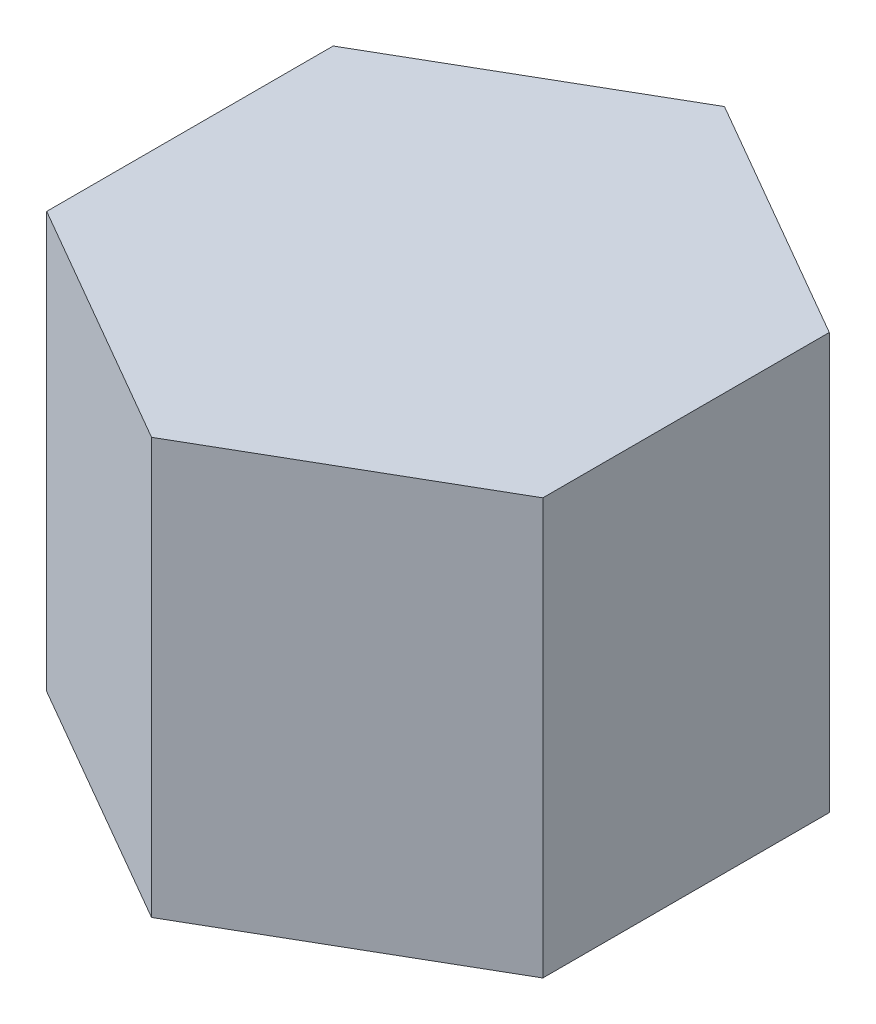
ISO-10303-21;
HEADER;
FILE_DESCRIPTION(('STEP AP214'),'2;1');
FILE_NAME('part.step','',(''),(''),'','','');
FILE_SCHEMA(('AUTOMOTIVE_DESIGN { 1 0 10303 214 1 1 1 1 }'));
ENDSEC;
DATA;
#1=APPLICATION_CONTEXT('core data for automotive mechanical design processes');
#2=APPLICATION_PROTOCOL_DEFINITION('international standard','automotive_design',2000,#1);
#3=PRODUCT_CONTEXT('',#1,'mechanical');
#4=PRODUCT('Part','Part','',(#3));
#5=PRODUCT_RELATED_PRODUCT_CATEGORY('part','',(#4));
#6=PRODUCT_DEFINITION_FORMATION('','',#4);
#7=PRODUCT_DEFINITION_CONTEXT('part definition',#1,'design');
#8=PRODUCT_DEFINITION('design','',#6,#7);
#9=PRODUCT_DEFINITION_SHAPE('','',#8);
#10=(LENGTH_UNIT() NAMED_UNIT(*) SI_UNIT(.MILLI.,.METRE.));
#11=(NAMED_UNIT(*) PLANE_ANGLE_UNIT() SI_UNIT($,.RADIAN.));
#12=(NAMED_UNIT(*) SI_UNIT($,.STERADIAN.) SOLID_ANGLE_UNIT());
#13=UNCERTAINTY_MEASURE_WITH_UNIT(LENGTH_MEASURE(1.E-05),#10,'distance_accuracy_value','');
#14=(GEOMETRIC_REPRESENTATION_CONTEXT(3) GLOBAL_UNCERTAINTY_ASSIGNED_CONTEXT((#13)) GLOBAL_UNIT_ASSIGNED_CONTEXT((#10,
#11,#12)) REPRESENTATION_CONTEXT('',''));
#15=CARTESIAN_POINT('',(0.,0.,0.));
#16=DIRECTION('',(0.,0.,1.));
#17=DIRECTION('',(1.,0.,0.));
#18=AXIS2_PLACEMENT_3D('',#15,#16,#17);
#19=CARTESIAN_POINT('',(204.642660308706,-148.537700895744,288.042869605357));
#20=DIRECTION('',(-0.499999999999943,0.,-0.866025403784472));
#21=DIRECTION('',(-0.866025403784472,0.,0.499999999999943));
#22=AXIS2_PLACEMENT_3D('',#19,#20,#21);
#23=PLANE('',#22);
#24=CARTESIAN_POINT('',(204.339551417382,-149.045793579175,288.217869605357));
#25=DIRECTION('',(0.866025403784471,0.,-0.499999999999943));
#26=VECTOR('',#25,1.);
#27=LINE('',#24,#26);
#28=CARTESIAN_POINT('',(204.339551417382,-149.045793579175,288.217869605357));
#29=VERTEX_POINT('',#28);
#30=CARTESIAN_POINT('',(204.642660308706,-149.045793579175,288.042869605357));
#31=VERTEX_POINT('',#30);
#32=EDGE_CURVE('E170',#29,#31,#27,.T.);
#33=ORIENTED_EDGE('',*,*,#32,.T.);
#34=CARTESIAN_POINT('',(204.642660308706,-148.537700895744,288.042869605357));
#35=DIRECTION('',(0.,-1.,0.));
#36=VECTOR('',#35,1.);
#37=LINE('',#34,#36);
#38=CARTESIAN_POINT('',(204.642660308706,-148.537700895744,288.042869605357));
#39=VERTEX_POINT('',#38);
#40=EDGE_CURVE('E35',#39,#31,#37,.T.);
#41=ORIENTED_EDGE('',*,*,#40,.F.);
#42=CARTESIAN_POINT('',(204.339551417382,-148.537700895744,288.217869605357));
#43=DIRECTION('',(0.866025403784471,0.,-0.499999999999943));
#44=VECTOR('',#43,1.);
#45=LINE('',#42,#44);
#46=CARTESIAN_POINT('',(204.339551417382,-148.537700895744,288.217869605357));
#47=VERTEX_POINT('',#46);
#48=EDGE_CURVE('E159',#47,#39,#45,.T.);
#49=ORIENTED_EDGE('',*,*,#48,.F.);
#50=CARTESIAN_POINT('',(204.339551417382,-148.537700895744,288.217869605357));
#51=DIRECTION('',(0.,-1.,0.));
#52=VECTOR('',#51,1.);
#53=LINE('',#50,#52);
#54=EDGE_CURVE('E10',#47,#29,#53,.T.);
#55=ORIENTED_EDGE('',*,*,#54,.T.);
#56=EDGE_LOOP('',(#33,#41,#49,#55));
#57=FACE_BOUND('',#56,.T.);
#58=ADVANCED_FACE('F16',(#57),#23,.F.);
#59=CARTESIAN_POINT('',(204.339551417382,-148.537700895744,288.217869605357));
#60=DIRECTION('',(0.499999999999978,0.,-0.866025403784452));
#61=DIRECTION('',(-0.866025403784452,0.,-0.499999999999978));
#62=AXIS2_PLACEMENT_3D('',#59,#60,#61);
#63=PLANE('',#62);
#64=CARTESIAN_POINT('',(204.036442526057,-149.045793579175,288.042869605357));
#65=DIRECTION('',(0.866025403784452,0.,0.499999999999978));
#66=VECTOR('',#65,1.);
#67=LINE('',#64,#66);
#68=CARTESIAN_POINT('',(204.036442526057,-149.045793579175,288.042869605357));
#69=VERTEX_POINT('',#68);
#70=EDGE_CURVE('E167',#69,#29,#67,.T.);
#71=ORIENTED_EDGE('',*,*,#70,.T.);
#72=ORIENTED_EDGE('',*,*,#54,.F.);
#73=CARTESIAN_POINT('',(204.036442526057,-148.537700895744,288.042869605357));
#74=DIRECTION('',(0.866025403784452,0.,0.499999999999978));
#75=VECTOR('',#74,1.);
#76=LINE('',#73,#75);
#77=CARTESIAN_POINT('',(204.036442526057,-148.537700895744,288.042869605357));
#78=VERTEX_POINT('',#77);
#79=EDGE_CURVE('E156',#78,#47,#76,.T.);
#80=ORIENTED_EDGE('',*,*,#79,.F.);
#81=CARTESIAN_POINT('',(204.036442526057,-148.537700895744,288.042869605357));
#82=DIRECTION('',(0.,-1.,0.));
#83=VECTOR('',#82,1.);
#84=LINE('',#81,#83);
#85=EDGE_CURVE('E27',#78,#69,#84,.T.);
#86=ORIENTED_EDGE('',*,*,#85,.T.);
#87=EDGE_LOOP('',(#71,#72,#80,#86));
#88=FACE_BOUND('',#87,.T.);
#89=ADVANCED_FACE('F189',(#88),#63,.F.);
#90=CARTESIAN_POINT('',(204.036442526057,-148.537700895744,290.831971220494));
#91=DIRECTION('',(1.,0.,0.));
#92=DIRECTION('',(0.,1.,0.));
#93=AXIS2_PLACEMENT_3D('',#90,#91,#92);
#94=PLANE('',#93);
#95=CARTESIAN_POINT('',(204.036442526057,-149.045793579175,287.692869605357));
#96=DIRECTION('',(0.,0.,1.));
#97=VECTOR('',#96,1.);
#98=LINE('',#95,#97);
#99=CARTESIAN_POINT('',(204.036442526057,-149.045793579175,287.692869605357));
#100=VERTEX_POINT('',#99);
#101=EDGE_CURVE('E163',#100,#69,#98,.T.);
#102=ORIENTED_EDGE('',*,*,#101,.T.);
#103=ORIENTED_EDGE('',*,*,#85,.F.);
#104=CARTESIAN_POINT('',(204.036442526057,-148.537700895744,287.692869605357));
#105=DIRECTION('',(0.,0.,1.));
#106=VECTOR('',#105,1.);
#107=LINE('',#104,#106);
#108=CARTESIAN_POINT('',(204.036442526057,-148.537700895744,287.692869605357));
#109=VERTEX_POINT('',#108);
#110=EDGE_CURVE('E106',#109,#78,#107,.T.);
#111=ORIENTED_EDGE('',*,*,#110,.F.);
#112=CARTESIAN_POINT('',(204.036442526057,-148.537700895744,287.692869605357));
#113=DIRECTION('',(0.,-1.,0.));
#114=VECTOR('',#113,1.);
#115=LINE('',#112,#114);
#116=EDGE_CURVE('E94',#109,#100,#115,.T.);
#117=ORIENTED_EDGE('',*,*,#116,.T.);
#118=EDGE_LOOP('',(#102,#103,#111,#117));
#119=FACE_BOUND('',#118,.T.);
#120=ADVANCED_FACE('F198',(#119),#94,.F.);
#121=CARTESIAN_POINT('',(204.036442526057,-148.537700895744,287.692869605357));
#122=DIRECTION('',(0.499999999999978,0.,0.866025403784452));
#123=DIRECTION('',(0.866025403784452,0.,-0.499999999999978));
#124=AXIS2_PLACEMENT_3D('',#121,#122,#123);
#125=PLANE('',#124);
#126=CARTESIAN_POINT('',(204.339551417382,-149.045793579175,287.517869605357));
#127=DIRECTION('',(-0.866025403784452,0.,0.499999999999978));
#128=VECTOR('',#127,1.);
#129=LINE('',#126,#128);
#130=CARTESIAN_POINT('',(204.339551417382,-149.045793579175,287.517869605357));
#131=VERTEX_POINT('',#130);
#132=EDGE_CURVE('E162',#131,#100,#129,.T.);
#133=ORIENTED_EDGE('',*,*,#132,.T.);
#134=ORIENTED_EDGE('',*,*,#116,.F.);
#135=CARTESIAN_POINT('',(204.339551417382,-148.537700895744,287.517869605357));
#136=DIRECTION('',(-0.866025403784452,0.,0.499999999999978));
#137=VECTOR('',#136,1.);
#138=LINE('',#135,#137);
#139=CARTESIAN_POINT('',(204.339551417382,-148.537700895744,287.517869605357));
#140=VERTEX_POINT('',#139);
#141=EDGE_CURVE('E98',#140,#109,#138,.T.);
#142=ORIENTED_EDGE('',*,*,#141,.F.);
#143=CARTESIAN_POINT('',(204.339551417382,-148.537700895744,287.517869605357));
#144=DIRECTION('',(0.,-1.,0.));
#145=VECTOR('',#144,1.);
#146=LINE('',#143,#145);
#147=EDGE_CURVE('E79',#140,#131,#146,.T.);
#148=ORIENTED_EDGE('',*,*,#147,.T.);
#149=EDGE_LOOP('',(#133,#134,#142,#148));
#150=FACE_BOUND('',#149,.T.);
#151=ADVANCED_FACE('F100',(#150),#125,.F.);
#152=CARTESIAN_POINT('',(204.339551417382,-148.537700895744,287.517869605357));
#153=DIRECTION('',(-0.499999999999978,0.,0.866025403784452));
#154=DIRECTION('',(0.866025403784452,0.,0.499999999999978));
#155=AXIS2_PLACEMENT_3D('',#152,#153,#154);
#156=PLANE('',#155);
#157=CARTESIAN_POINT('',(204.642660308706,-149.045793579175,287.692869605357));
#158=DIRECTION('',(-0.866025403784452,0.,-0.499999999999978));
#159=VECTOR('',#158,1.);
#160=LINE('',#157,#159);
#161=CARTESIAN_POINT('',(204.642660308706,-149.045793579175,287.692869605357));
#162=VERTEX_POINT('',#161);
#163=EDGE_CURVE('E88',#162,#131,#160,.T.);
#164=ORIENTED_EDGE('',*,*,#163,.T.);
#165=ORIENTED_EDGE('',*,*,#147,.F.);
#166=CARTESIAN_POINT('',(204.642660308706,-148.537700895744,287.692869605357));
#167=DIRECTION('',(-0.866025403784452,0.,-0.499999999999978));
#168=VECTOR('',#167,1.);
#169=LINE('',#166,#168);
#170=CARTESIAN_POINT('',(204.642660308706,-148.537700895744,287.692869605357));
#171=VERTEX_POINT('',#170);
#172=EDGE_CURVE('E84',#171,#140,#169,.T.);
#173=ORIENTED_EDGE('',*,*,#172,.F.);
#174=CARTESIAN_POINT('',(204.642660308706,-148.537700895744,287.692869605357));
#175=DIRECTION('',(0.,-1.,0.));
#176=VECTOR('',#175,1.);
#177=LINE('',#174,#176);
#178=EDGE_CURVE('E58',#171,#162,#177,.T.);
#179=ORIENTED_EDGE('',*,*,#178,.T.);
#180=EDGE_LOOP('',(#164,#165,#173,#179));
#181=FACE_BOUND('',#180,.T.);
#182=ADVANCED_FACE('F82',(#181),#156,.F.);
#183=CARTESIAN_POINT('',(204.642660308706,-148.537700895744,290.831971220494));
#184=DIRECTION('',(-1.,0.,0.));
#185=DIRECTION('',(0.,-1.,0.));
#186=AXIS2_PLACEMENT_3D('',#183,#184,#185);
#187=PLANE('',#186);
#188=CARTESIAN_POINT('',(204.642660308706,-149.045793579175,288.042869605357));
#189=DIRECTION('',(0.,0.,-1.));
#190=VECTOR('',#189,1.);
#191=LINE('',#188,#190);
#192=EDGE_CURVE('E160',#31,#162,#191,.T.);
#193=ORIENTED_EDGE('',*,*,#192,.T.);
#194=ORIENTED_EDGE('',*,*,#178,.F.);
#195=CARTESIAN_POINT('',(204.642660308706,-148.537700895744,288.042869605357));
#196=DIRECTION('',(0.,0.,-1.));
#197=VECTOR('',#196,1.);
#198=LINE('',#195,#197);
#199=EDGE_CURVE('E112',#39,#171,#198,.T.);
#200=ORIENTED_EDGE('',*,*,#199,.F.);
#201=ORIENTED_EDGE('',*,*,#40,.T.);
#202=EDGE_LOOP('',(#193,#194,#200,#201));
#203=FACE_BOUND('',#202,.T.);
#204=ADVANCED_FACE('F131',(#203),#187,.F.);
#205=CARTESIAN_POINT('',(206.339551417382,-148.537700895744,290.831971220494));
#206=DIRECTION('',(0.,-1.,0.));
#207=DIRECTION('',(1.,0.,0.));
#208=AXIS2_PLACEMENT_3D('',#205,#206,#207);
#209=PLANE('',#208);
#210=ORIENTED_EDGE('',*,*,#48,.T.);
#211=ORIENTED_EDGE('',*,*,#199,.T.);
#212=ORIENTED_EDGE('',*,*,#172,.T.);
#213=ORIENTED_EDGE('',*,*,#141,.T.);
#214=ORIENTED_EDGE('',*,*,#110,.T.);
#215=ORIENTED_EDGE('',*,*,#79,.T.);
#216=EDGE_LOOP('',(#210,#211,#212,#213,#214,#215));
#217=FACE_BOUND('',#216,.T.);
#218=ADVANCED_FACE('F111',(#217),#209,.F.);
#219=CARTESIAN_POINT('',(206.339551417382,-149.045793579175,290.831971220494));
#220=DIRECTION('',(0.,-1.,0.));
#221=DIRECTION('',(1.,0.,0.));
#222=AXIS2_PLACEMENT_3D('',#219,#220,#221);
#223=PLANE('',#222);
#224=ORIENTED_EDGE('',*,*,#32,.F.);
#225=ORIENTED_EDGE('',*,*,#70,.F.);
#226=ORIENTED_EDGE('',*,*,#101,.F.);
#227=ORIENTED_EDGE('',*,*,#132,.F.);
#228=ORIENTED_EDGE('',*,*,#163,.F.);
#229=ORIENTED_EDGE('',*,*,#192,.F.);
#230=EDGE_LOOP('',(#224,#225,#226,#227,#228,#229));
#231=FACE_BOUND('',#230,.T.);
#232=ADVANCED_FACE('F130',(#231),#223,.T.);
#233=CLOSED_SHELL('',(#58,#89,#120,#151,#182,#204,#218,#232));
#234=MANIFOLD_SOLID_BREP('B1',#233);
#235=ADVANCED_BREP_SHAPE_REPRESENTATION('',(#18,#234),#14);
#236=SHAPE_DEFINITION_REPRESENTATION(#9,#235);
ENDSEC;
END-ISO-10303-21;
